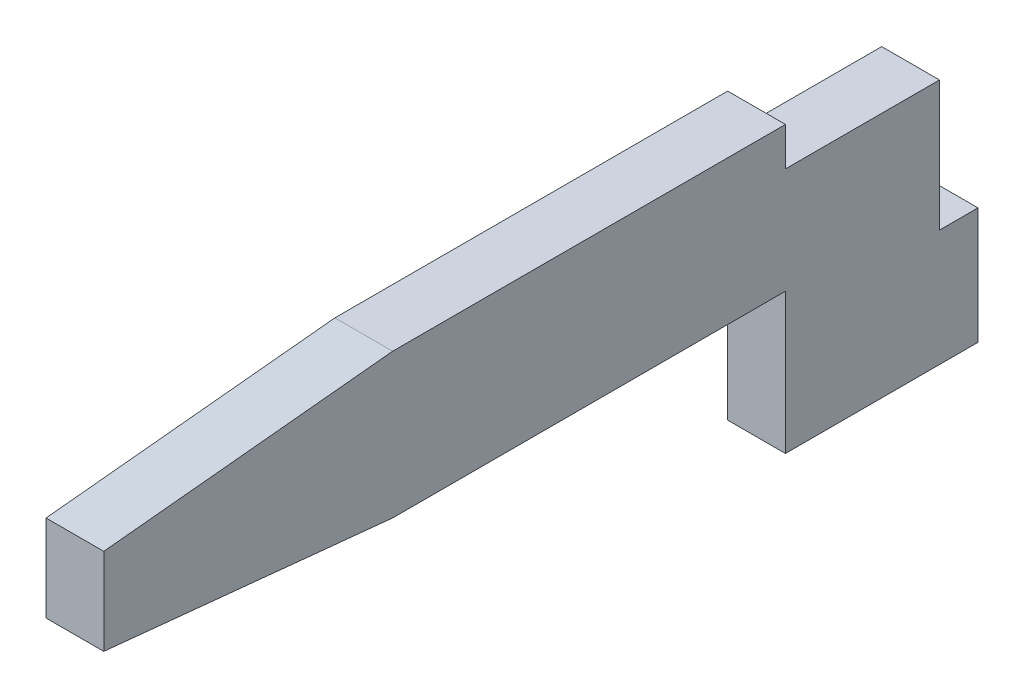
ISO-10303-21;
HEADER;
FILE_DESCRIPTION(('STEP AP214'),'2;1');
FILE_NAME('part.step','',(''),(''),'','','');
FILE_SCHEMA(('AUTOMOTIVE_DESIGN { 1 0 10303 214 1 1 1 1 }'));
ENDSEC;
DATA;
#1=APPLICATION_CONTEXT('core data for automotive mechanical design processes');
#2=APPLICATION_PROTOCOL_DEFINITION('international standard','automotive_design',2000,#1);
#3=PRODUCT_CONTEXT('',#1,'mechanical');
#4=PRODUCT('Part','Part','',(#3));
#5=PRODUCT_RELATED_PRODUCT_CATEGORY('part','',(#4));
#6=PRODUCT_DEFINITION_FORMATION('','',#4);
#7=PRODUCT_DEFINITION_CONTEXT('part definition',#1,'design');
#8=PRODUCT_DEFINITION('design','',#6,#7);
#9=PRODUCT_DEFINITION_SHAPE('','',#8);
#10=(LENGTH_UNIT() NAMED_UNIT(*) SI_UNIT(.MILLI.,.METRE.));
#11=(NAMED_UNIT(*) PLANE_ANGLE_UNIT() SI_UNIT($,.RADIAN.));
#12=(NAMED_UNIT(*) SI_UNIT($,.STERADIAN.) SOLID_ANGLE_UNIT());
#13=UNCERTAINTY_MEASURE_WITH_UNIT(LENGTH_MEASURE(1.E-05),#10,'distance_accuracy_value','');
#14=(GEOMETRIC_REPRESENTATION_CONTEXT(3) GLOBAL_UNCERTAINTY_ASSIGNED_CONTEXT((#13)) GLOBAL_UNIT_ASSIGNED_CONTEXT((#10,
#11,#12)) REPRESENTATION_CONTEXT('',''));
#15=CARTESIAN_POINT('',(0.,0.,0.));
#16=DIRECTION('',(0.,0.,1.));
#17=DIRECTION('',(1.,0.,0.));
#18=AXIS2_PLACEMENT_3D('',#15,#16,#17);
#19=CARTESIAN_POINT('',(0.15,0.,0.));
#20=DIRECTION('',(1.,0.,0.));
#21=DIRECTION('',(0.,0.,-1.));
#22=AXIS2_PLACEMENT_3D('',#19,#20,#21);
#23=PLANE('',#22);
#24=DIRECTION('',(0.,0.,-1.));
#25=VECTOR('',#24,1.);
#26=CARTESIAN_POINT('',(0.15,0.,0.4));
#27=LINE('',#26,#25);
#28=CARTESIAN_POINT('',(0.15,0.,-0.4));
#29=VERTEX_POINT('',#28);
#30=CARTESIAN_POINT('',(0.15,0.,0.4));
#31=VERTEX_POINT('',#30);
#32=EDGE_CURVE('E155',#29,#31,#27,.F.);
#33=ORIENTED_EDGE('',*,*,#32,.T.);
#34=DIRECTION('',(0.,1.,0.));
#35=VECTOR('',#34,1.);
#36=CARTESIAN_POINT('',(0.15,0.2,0.4));
#37=LINE('',#36,#35);
#38=CARTESIAN_POINT('',(0.15,0.2,0.4));
#39=VERTEX_POINT('',#38);
#40=EDGE_CURVE('E160',#31,#39,#37,.T.);
#41=ORIENTED_EDGE('',*,*,#40,.T.);
#42=DIRECTION('',(0.,0.,-1.));
#43=VECTOR('',#42,1.);
#44=CARTESIAN_POINT('',(0.15,0.2,3.94));
#45=LINE('',#44,#43);
#46=CARTESIAN_POINT('',(0.15,0.199999999999999,2.44000000000002));
#47=VERTEX_POINT('',#46);
#48=EDGE_CURVE('E108',#39,#47,#45,.F.);
#49=ORIENTED_EDGE('',*,*,#48,.T.);
#50=DIRECTION('',(0.,-0.0995037190209989,0.995037190209989));
#51=VECTOR('',#50,1.);
#52=CARTESIAN_POINT('',(0.15,0.2,2.44));
#53=LINE('',#52,#51);
#54=CARTESIAN_POINT('',(0.15,0.05,3.94));
#55=VERTEX_POINT('',#54);
#56=EDGE_CURVE('E20',#47,#55,#53,.T.);
#57=ORIENTED_EDGE('',*,*,#56,.T.);
#58=DIRECTION('',(0.,1.,0.));
#59=VECTOR('',#58,1.);
#60=CARTESIAN_POINT('',(0.15,0.,3.94));
#61=LINE('',#60,#59);
#62=CARTESIAN_POINT('',(0.15,-0.4,3.94));
#63=VERTEX_POINT('',#62);
#64=EDGE_CURVE('E106',#55,#63,#61,.F.);
#65=ORIENTED_EDGE('',*,*,#64,.T.);
#66=DIRECTION('',(0.,0.0995037190209989,0.995037190209989));
#67=VECTOR('',#66,1.);
#68=CARTESIAN_POINT('',(0.15,-0.55,2.44));
#69=LINE('',#68,#67);
#70=CARTESIAN_POINT('',(0.15,-0.55,2.44));
#71=VERTEX_POINT('',#70);
#72=EDGE_CURVE('E102',#63,#71,#69,.F.);
#73=ORIENTED_EDGE('',*,*,#72,.T.);
#74=DIRECTION('',(0.,0.,1.));
#75=VECTOR('',#74,1.);
#76=CARTESIAN_POINT('',(0.15,-0.55,3.94));
#77=LINE('',#76,#75);
#78=CARTESIAN_POINT('',(0.15,-0.55,0.4));
#79=VERTEX_POINT('',#78);
#80=EDGE_CURVE('E125',#71,#79,#77,.F.);
#81=ORIENTED_EDGE('',*,*,#80,.T.);
#82=DIRECTION('',(0.,1.,0.));
#83=VECTOR('',#82,1.);
#84=CARTESIAN_POINT('',(0.15,-1.28,0.4));
#85=LINE('',#84,#83);
#86=CARTESIAN_POINT('',(0.15,-1.28,0.4));
#87=VERTEX_POINT('',#86);
#88=EDGE_CURVE('E130',#79,#87,#85,.F.);
#89=ORIENTED_EDGE('',*,*,#88,.T.);
#90=DIRECTION('',(0.,0.,1.));
#91=VECTOR('',#90,1.);
#92=CARTESIAN_POINT('',(0.15,-1.28,-0.6));
#93=LINE('',#92,#91);
#94=CARTESIAN_POINT('',(0.15,-1.28,-0.6));
#95=VERTEX_POINT('',#94);
#96=EDGE_CURVE('E135',#87,#95,#93,.F.);
#97=ORIENTED_EDGE('',*,*,#96,.T.);
#98=DIRECTION('',(0.,1.,0.));
#99=VECTOR('',#98,1.);
#100=CARTESIAN_POINT('',(0.15,-0.675293774103,-0.6));
#101=LINE('',#100,#99);
#102=CARTESIAN_POINT('',(0.15,-0.675293774103,-0.6));
#103=VERTEX_POINT('',#102);
#104=EDGE_CURVE('E140',#95,#103,#101,.T.);
#105=ORIENTED_EDGE('',*,*,#104,.T.);
#106=DIRECTION('',(0.,0.,-1.));
#107=VECTOR('',#106,1.);
#108=CARTESIAN_POINT('',(0.15,-0.675293774103,-0.4));
#109=LINE('',#108,#107);
#110=CARTESIAN_POINT('',(0.15,-0.675293774103,-0.4));
#111=VERTEX_POINT('',#110);
#112=EDGE_CURVE('E145',#103,#111,#109,.F.);
#113=ORIENTED_EDGE('',*,*,#112,.T.);
#114=DIRECTION('',(0.,1.,0.));
#115=VECTOR('',#114,1.);
#116=CARTESIAN_POINT('',(0.15,0.,-0.4));
#117=LINE('',#116,#115);
#118=EDGE_CURVE('E150',#111,#29,#117,.T.);
#119=ORIENTED_EDGE('',*,*,#118,.T.);
#120=EDGE_LOOP('',(#33,#41,#49,#57,#65,#73,#81,#89,#97,#105,#113,#119));
#121=FACE_BOUND('',#120,.T.);
#122=ADVANCED_FACE('F17',(#121),#23,.T.);
#123=CARTESIAN_POINT('',(0.15,-0.55,2.44));
#124=DIRECTION('',(0.,0.995037190209989,-0.0995037190209989));
#125=DIRECTION('',(0.,0.0995037190209989,0.995037190209989));
#126=AXIS2_PLACEMENT_3D('',#123,#124,#125);
#127=PLANE('',#126);
#128=DIRECTION('',(-1.,0.,0.));
#129=VECTOR('',#128,1.);
#130=CARTESIAN_POINT('',(0.15,-0.4,3.94));
#131=LINE('',#130,#129);
#132=CARTESIAN_POINT('',(-0.15,-0.4,3.94));
#133=VERTEX_POINT('',#132);
#134=EDGE_CURVE('E115',#63,#133,#131,.T.);
#135=ORIENTED_EDGE('',*,*,#134,.T.);
#136=DIRECTION('',(0.,-0.0995037190209989,-0.995037190209989));
#137=VECTOR('',#136,1.);
#138=CARTESIAN_POINT('',(-0.15,-0.4,3.94));
#139=LINE('',#138,#137);
#140=CARTESIAN_POINT('',(-0.15,-0.55,2.44));
#141=VERTEX_POINT('',#140);
#142=EDGE_CURVE('E114',#133,#141,#139,.T.);
#143=ORIENTED_EDGE('',*,*,#142,.T.);
#144=DIRECTION('',(1.,0.,0.));
#145=VECTOR('',#144,1.);
#146=CARTESIAN_POINT('',(0.15,-0.55,2.44));
#147=LINE('',#146,#145);
#148=EDGE_CURVE('E120',#141,#71,#147,.T.);
#149=ORIENTED_EDGE('',*,*,#148,.T.);
#150=ORIENTED_EDGE('',*,*,#72,.F.);
#151=EDGE_LOOP('',(#135,#143,#149,#150));
#152=FACE_BOUND('',#151,.T.);
#153=ADVANCED_FACE('F235',(#152),#127,.F.);
#154=CARTESIAN_POINT('',(0.15,-0.55,3.94));
#155=DIRECTION('',(0.,1.,0.));
#156=DIRECTION('',(0.,0.,1.));
#157=AXIS2_PLACEMENT_3D('',#154,#155,#156);
#158=PLANE('',#157);
#159=ORIENTED_EDGE('',*,*,#148,.F.);
#160=DIRECTION('',(0.,0.,-1.));
#161=VECTOR('',#160,1.);
#162=CARTESIAN_POINT('',(-0.15,-0.55,0.));
#163=LINE('',#162,#161);
#164=CARTESIAN_POINT('',(-0.15,-0.55,0.4));
#165=VERTEX_POINT('',#164);
#166=EDGE_CURVE('E171',#141,#165,#163,.T.);
#167=ORIENTED_EDGE('',*,*,#166,.T.);
#168=DIRECTION('',(-1.,0.,0.));
#169=VECTOR('',#168,1.);
#170=CARTESIAN_POINT('',(0.15,-0.55,0.4));
#171=LINE('',#170,#169);
#172=EDGE_CURVE('E127',#165,#79,#171,.F.);
#173=ORIENTED_EDGE('',*,*,#172,.T.);
#174=ORIENTED_EDGE('',*,*,#80,.F.);
#175=EDGE_LOOP('',(#159,#167,#173,#174));
#176=FACE_BOUND('',#175,.T.);
#177=ADVANCED_FACE('F233',(#176),#158,.F.);
#178=CARTESIAN_POINT('',(0.15,-1.28,0.4));
#179=DIRECTION('',(0.,0.,-1.));
#180=DIRECTION('',(-1.,0.,0.));
#181=AXIS2_PLACEMENT_3D('',#178,#179,#180);
#182=PLANE('',#181);
#183=DIRECTION('',(1.,0.,0.));
#184=VECTOR('',#183,1.);
#185=CARTESIAN_POINT('',(0.15,-1.28,0.4));
#186=LINE('',#185,#184);
#187=CARTESIAN_POINT('',(-0.15,-1.28,0.4));
#188=VERTEX_POINT('',#187);
#189=EDGE_CURVE('E132',#188,#87,#186,.T.);
#190=ORIENTED_EDGE('',*,*,#189,.T.);
#191=ORIENTED_EDGE('',*,*,#88,.F.);
#192=ORIENTED_EDGE('',*,*,#172,.F.);
#193=DIRECTION('',(0.,1.,0.));
#194=VECTOR('',#193,1.);
#195=CARTESIAN_POINT('',(-0.15,0.,0.4));
#196=LINE('',#195,#194);
#197=EDGE_CURVE('E174',#165,#188,#196,.F.);
#198=ORIENTED_EDGE('',*,*,#197,.T.);
#199=EDGE_LOOP('',(#190,#191,#192,#198));
#200=FACE_BOUND('',#199,.T.);
#201=ADVANCED_FACE('F230',(#200),#182,.F.);
#202=CARTESIAN_POINT('',(0.15,-1.28,-0.6));
#203=DIRECTION('',(0.,1.,0.));
#204=DIRECTION('',(0.,0.,1.));
#205=AXIS2_PLACEMENT_3D('',#202,#203,#204);
#206=PLANE('',#205);
#207=DIRECTION('',(1.,0.,0.));
#208=VECTOR('',#207,1.);
#209=CARTESIAN_POINT('',(0.15,-1.28,-0.6));
#210=LINE('',#209,#208);
#211=CARTESIAN_POINT('',(-0.15,-1.28,-0.6));
#212=VERTEX_POINT('',#211);
#213=EDGE_CURVE('E137',#212,#95,#210,.T.);
#214=ORIENTED_EDGE('',*,*,#213,.T.);
#215=ORIENTED_EDGE('',*,*,#96,.F.);
#216=ORIENTED_EDGE('',*,*,#189,.F.);
#217=DIRECTION('',(0.,0.,-1.));
#218=VECTOR('',#217,1.);
#219=CARTESIAN_POINT('',(-0.15,-1.28,0.));
#220=LINE('',#219,#218);
#221=EDGE_CURVE('E177',#188,#212,#220,.T.);
#222=ORIENTED_EDGE('',*,*,#221,.T.);
#223=EDGE_LOOP('',(#214,#215,#216,#222));
#224=FACE_BOUND('',#223,.T.);
#225=ADVANCED_FACE('F226',(#224),#206,.F.);
#226=CARTESIAN_POINT('',(0.15,-0.675293774103,-0.6));
#227=DIRECTION('',(0.,0.,1.));
#228=DIRECTION('',(1.,0.,0.));
#229=AXIS2_PLACEMENT_3D('',#226,#227,#228);
#230=PLANE('',#229);
#231=DIRECTION('',(1.,0.,0.));
#232=VECTOR('',#231,1.);
#233=CARTESIAN_POINT('',(0.15,-0.675293774103,-0.6));
#234=LINE('',#233,#232);
#235=CARTESIAN_POINT('',(-0.15,-0.675293774103,-0.6));
#236=VERTEX_POINT('',#235);
#237=EDGE_CURVE('E142',#236,#103,#234,.T.);
#238=ORIENTED_EDGE('',*,*,#237,.T.);
#239=ORIENTED_EDGE('',*,*,#104,.F.);
#240=ORIENTED_EDGE('',*,*,#213,.F.);
#241=DIRECTION('',(0.,1.,0.));
#242=VECTOR('',#241,1.);
#243=CARTESIAN_POINT('',(-0.15,0.,-0.6));
#244=LINE('',#243,#242);
#245=EDGE_CURVE('E180',#212,#236,#244,.T.);
#246=ORIENTED_EDGE('',*,*,#245,.T.);
#247=EDGE_LOOP('',(#238,#239,#240,#246));
#248=FACE_BOUND('',#247,.T.);
#249=ADVANCED_FACE('F222',(#248),#230,.F.);
#250=CARTESIAN_POINT('',(0.15,-0.675293774103,-0.4));
#251=DIRECTION('',(0.,-1.,0.));
#252=DIRECTION('',(0.,0.,-1.));
#253=AXIS2_PLACEMENT_3D('',#250,#251,#252);
#254=PLANE('',#253);
#255=DIRECTION('',(1.,0.,0.));
#256=VECTOR('',#255,1.);
#257=CARTESIAN_POINT('',(0.15,-0.675293774103,-0.4));
#258=LINE('',#257,#256);
#259=CARTESIAN_POINT('',(-0.15,-0.675293774103,-0.4));
#260=VERTEX_POINT('',#259);
#261=EDGE_CURVE('E147',#260,#111,#258,.T.);
#262=ORIENTED_EDGE('',*,*,#261,.T.);
#263=ORIENTED_EDGE('',*,*,#112,.F.);
#264=ORIENTED_EDGE('',*,*,#237,.F.);
#265=DIRECTION('',(0.,0.,-1.));
#266=VECTOR('',#265,1.);
#267=CARTESIAN_POINT('',(-0.15,-0.675293774103,0.));
#268=LINE('',#267,#266);
#269=EDGE_CURVE('E183',#236,#260,#268,.F.);
#270=ORIENTED_EDGE('',*,*,#269,.T.);
#271=EDGE_LOOP('',(#262,#263,#264,#270));
#272=FACE_BOUND('',#271,.T.);
#273=ADVANCED_FACE('F218',(#272),#254,.F.);
#274=CARTESIAN_POINT('',(0.15,0.,-0.4));
#275=DIRECTION('',(0.,0.,1.));
#276=DIRECTION('',(1.,0.,0.));
#277=AXIS2_PLACEMENT_3D('',#274,#275,#276);
#278=PLANE('',#277);
#279=DIRECTION('',(1.,0.,0.));
#280=VECTOR('',#279,1.);
#281=CARTESIAN_POINT('',(0.15,0.,-0.4));
#282=LINE('',#281,#280);
#283=CARTESIAN_POINT('',(-0.15,0.,-0.4));
#284=VERTEX_POINT('',#283);
#285=EDGE_CURVE('E152',#284,#29,#282,.T.);
#286=ORIENTED_EDGE('',*,*,#285,.T.);
#287=ORIENTED_EDGE('',*,*,#118,.F.);
#288=ORIENTED_EDGE('',*,*,#261,.F.);
#289=DIRECTION('',(0.,1.,0.));
#290=VECTOR('',#289,1.);
#291=CARTESIAN_POINT('',(-0.15,0.,-0.4));
#292=LINE('',#291,#290);
#293=EDGE_CURVE('E186',#260,#284,#292,.T.);
#294=ORIENTED_EDGE('',*,*,#293,.T.);
#295=EDGE_LOOP('',(#286,#287,#288,#294));
#296=FACE_BOUND('',#295,.T.);
#297=ADVANCED_FACE('F214',(#296),#278,.F.);
#298=CARTESIAN_POINT('',(0.15,0.,0.4));
#299=DIRECTION('',(0.,-1.,0.));
#300=DIRECTION('',(0.,0.,-1.));
#301=AXIS2_PLACEMENT_3D('',#298,#299,#300);
#302=PLANE('',#301);
#303=DIRECTION('',(1.,0.,0.));
#304=VECTOR('',#303,1.);
#305=CARTESIAN_POINT('',(0.15,0.,0.4));
#306=LINE('',#305,#304);
#307=CARTESIAN_POINT('',(-0.15,0.,0.4));
#308=VERTEX_POINT('',#307);
#309=EDGE_CURVE('E157',#308,#31,#306,.T.);
#310=ORIENTED_EDGE('',*,*,#309,.T.);
#311=ORIENTED_EDGE('',*,*,#32,.F.);
#312=ORIENTED_EDGE('',*,*,#285,.F.);
#313=DIRECTION('',(0.,0.,-1.));
#314=VECTOR('',#313,1.);
#315=CARTESIAN_POINT('',(-0.15,0.,0.));
#316=LINE('',#315,#314);
#317=EDGE_CURVE('E189',#284,#308,#316,.F.);
#318=ORIENTED_EDGE('',*,*,#317,.T.);
#319=EDGE_LOOP('',(#310,#311,#312,#318));
#320=FACE_BOUND('',#319,.T.);
#321=ADVANCED_FACE('F210',(#320),#302,.F.);
#322=CARTESIAN_POINT('',(0.15,0.2,0.4));
#323=DIRECTION('',(0.,0.,1.));
#324=DIRECTION('',(1.,0.,0.));
#325=AXIS2_PLACEMENT_3D('',#322,#323,#324);
#326=PLANE('',#325);
#327=DIRECTION('',(1.,0.,0.));
#328=VECTOR('',#327,1.);
#329=CARTESIAN_POINT('',(0.15,0.2,0.4));
#330=LINE('',#329,#328);
#331=CARTESIAN_POINT('',(-0.15,0.2,0.4));
#332=VERTEX_POINT('',#331);
#333=EDGE_CURVE('E162',#332,#39,#330,.T.);
#334=ORIENTED_EDGE('',*,*,#333,.T.);
#335=ORIENTED_EDGE('',*,*,#40,.F.);
#336=ORIENTED_EDGE('',*,*,#309,.F.);
#337=DIRECTION('',(0.,1.,0.));
#338=VECTOR('',#337,1.);
#339=CARTESIAN_POINT('',(-0.15,0.,0.4));
#340=LINE('',#339,#338);
#341=EDGE_CURVE('E192',#308,#332,#340,.T.);
#342=ORIENTED_EDGE('',*,*,#341,.T.);
#343=EDGE_LOOP('',(#334,#335,#336,#342));
#344=FACE_BOUND('',#343,.T.);
#345=ADVANCED_FACE('F206',(#344),#326,.F.);
#346=CARTESIAN_POINT('',(0.15,0.2,3.94));
#347=DIRECTION('',(0.,-1.,0.));
#348=DIRECTION('',(0.,0.,-1.));
#349=AXIS2_PLACEMENT_3D('',#346,#347,#348);
#350=PLANE('',#349);
#351=DIRECTION('',(1.,0.,0.));
#352=VECTOR('',#351,1.);
#353=CARTESIAN_POINT('',(0.15,0.2,2.44));
#354=LINE('',#353,#352);
#355=CARTESIAN_POINT('',(-0.15,0.2,2.44000000000001));
#356=VERTEX_POINT('',#355);
#357=EDGE_CURVE('E166',#356,#47,#354,.T.);
#358=ORIENTED_EDGE('',*,*,#357,.T.);
#359=ORIENTED_EDGE('',*,*,#48,.F.);
#360=ORIENTED_EDGE('',*,*,#333,.F.);
#361=DIRECTION('',(0.,0.,-1.));
#362=VECTOR('',#361,1.);
#363=CARTESIAN_POINT('',(-0.15,0.2,0.));
#364=LINE('',#363,#362);
#365=EDGE_CURVE('E195',#332,#356,#364,.F.);
#366=ORIENTED_EDGE('',*,*,#365,.T.);
#367=EDGE_LOOP('',(#358,#359,#360,#366));
#368=FACE_BOUND('',#367,.T.);
#369=ADVANCED_FACE('F200',(#368),#350,.F.);
#370=CARTESIAN_POINT('',(0.15,0.05,3.94));
#371=DIRECTION('',(0.,-0.995037190209989,-0.0995037190209989));
#372=DIRECTION('',(0.,0.0995037190209989,-0.995037190209989));
#373=AXIS2_PLACEMENT_3D('',#370,#371,#372);
#374=PLANE('',#373);
#375=ORIENTED_EDGE('',*,*,#357,.F.);
#376=DIRECTION('',(0.,-0.0995037190209989,0.995037190209989));
#377=VECTOR('',#376,1.);
#378=CARTESIAN_POINT('',(-0.15,0.2,2.44));
#379=LINE('',#378,#377);
#380=CARTESIAN_POINT('',(-0.15,0.05,3.94));
#381=VERTEX_POINT('',#380);
#382=EDGE_CURVE('E26',#356,#381,#379,.T.);
#383=ORIENTED_EDGE('',*,*,#382,.T.);
#384=DIRECTION('',(-1.,0.,0.));
#385=VECTOR('',#384,1.);
#386=CARTESIAN_POINT('',(0.15,0.05,3.94));
#387=LINE('',#386,#385);
#388=EDGE_CURVE('E34',#381,#55,#387,.F.);
#389=ORIENTED_EDGE('',*,*,#388,.T.);
#390=ORIENTED_EDGE('',*,*,#56,.F.);
#391=EDGE_LOOP('',(#375,#383,#389,#390));
#392=FACE_BOUND('',#391,.T.);
#393=ADVANCED_FACE('F112',(#392),#374,.F.);
#394=CARTESIAN_POINT('',(0.15,-0.55,3.94));
#395=DIRECTION('',(0.,0.,-1.));
#396=DIRECTION('',(-1.,0.,0.));
#397=AXIS2_PLACEMENT_3D('',#394,#395,#396);
#398=PLANE('',#397);
#399=ORIENTED_EDGE('',*,*,#388,.F.);
#400=DIRECTION('',(0.,1.,0.));
#401=VECTOR('',#400,1.);
#402=CARTESIAN_POINT('',(-0.15,0.,3.94));
#403=LINE('',#402,#401);
#404=EDGE_CURVE('E11',#381,#133,#403,.F.);
#405=ORIENTED_EDGE('',*,*,#404,.T.);
#406=ORIENTED_EDGE('',*,*,#134,.F.);
#407=ORIENTED_EDGE('',*,*,#64,.F.);
#408=EDGE_LOOP('',(#399,#405,#406,#407));
#409=FACE_BOUND('',#408,.T.);
#410=ADVANCED_FACE('F118',(#409),#398,.F.);
#411=CARTESIAN_POINT('',(-0.15,0.,0.));
#412=DIRECTION('',(1.,0.,0.));
#413=DIRECTION('',(0.,0.,-1.));
#414=AXIS2_PLACEMENT_3D('',#411,#412,#413);
#415=PLANE('',#414);
#416=ORIENTED_EDGE('',*,*,#382,.F.);
#417=ORIENTED_EDGE('',*,*,#365,.F.);
#418=ORIENTED_EDGE('',*,*,#341,.F.);
#419=ORIENTED_EDGE('',*,*,#317,.F.);
#420=ORIENTED_EDGE('',*,*,#293,.F.);
#421=ORIENTED_EDGE('',*,*,#269,.F.);
#422=ORIENTED_EDGE('',*,*,#245,.F.);
#423=ORIENTED_EDGE('',*,*,#221,.F.);
#424=ORIENTED_EDGE('',*,*,#197,.F.);
#425=ORIENTED_EDGE('',*,*,#166,.F.);
#426=ORIENTED_EDGE('',*,*,#142,.F.);
#427=ORIENTED_EDGE('',*,*,#404,.F.);
#428=EDGE_LOOP('',(#416,#417,#418,#419,#420,#421,#422,#423,#424,#425,#426,#427));
#429=FACE_BOUND('',#428,.T.);
#430=ADVANCED_FACE('F203',(#429),#415,.F.);
#431=CLOSED_SHELL('',(#122,#153,#177,#201,#225,#249,#273,#297,#321,#345,#369,#393,#410,#430));
#432=MANIFOLD_SOLID_BREP('B1',#431);
#433=ADVANCED_BREP_SHAPE_REPRESENTATION('',(#18,#432),#14);
#434=SHAPE_DEFINITION_REPRESENTATION(#9,#433);
ENDSEC;
END-ISO-10303-21;
